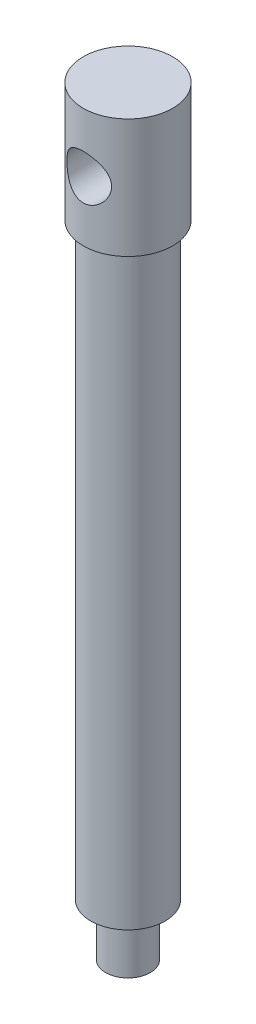
ISO-10303-21;
HEADER;
FILE_DESCRIPTION(('STEP AP214'),'2;1');
FILE_NAME('part.step','',(''),(''),'','','');
FILE_SCHEMA(('AUTOMOTIVE_DESIGN { 1 0 10303 214 1 1 1 1 }'));
ENDSEC;
DATA;
#1=APPLICATION_CONTEXT('core data for automotive mechanical design processes');
#2=APPLICATION_PROTOCOL_DEFINITION('international standard','automotive_design',2000,#1);
#3=PRODUCT_CONTEXT('',#1,'mechanical');
#4=PRODUCT('Part','Part','',(#3));
#5=PRODUCT_RELATED_PRODUCT_CATEGORY('part','',(#4));
#6=PRODUCT_DEFINITION_FORMATION('','',#4);
#7=PRODUCT_DEFINITION_CONTEXT('part definition',#1,'design');
#8=PRODUCT_DEFINITION('design','',#6,#7);
#9=PRODUCT_DEFINITION_SHAPE('','',#8);
#10=(LENGTH_UNIT() NAMED_UNIT(*) SI_UNIT(.MILLI.,.METRE.));
#11=(NAMED_UNIT(*) PLANE_ANGLE_UNIT() SI_UNIT($,.RADIAN.));
#12=(NAMED_UNIT(*) SI_UNIT($,.STERADIAN.) SOLID_ANGLE_UNIT());
#13=UNCERTAINTY_MEASURE_WITH_UNIT(LENGTH_MEASURE(1.E-05),#10,'distance_accuracy_value','');
#14=(GEOMETRIC_REPRESENTATION_CONTEXT(3) GLOBAL_UNCERTAINTY_ASSIGNED_CONTEXT((#13)) GLOBAL_UNIT_ASSIGNED_CONTEXT((#10,
#11,#12)) REPRESENTATION_CONTEXT('',''));
#15=CARTESIAN_POINT('',(0.,0.,0.));
#16=DIRECTION('',(0.,0.,1.));
#17=DIRECTION('',(1.,0.,0.));
#18=AXIS2_PLACEMENT_3D('',#15,#16,#17);
#19=CARTESIAN_POINT('',(0.,8.,0.));
#20=DIRECTION('',(0.,-1.,0.));
#21=DIRECTION('',(0.,0.,-1.));
#22=AXIS2_PLACEMENT_3D('',#19,#20,#21);
#23=CYLINDRICAL_SURFACE('',#22,6.);
#24=CARTESIAN_POINT('',(0.,3.,-6.));
#25=CARTESIAN_POINT('',(-0.0788941476270899,2.99999916125949,-5.99999934964153));
#26=CARTESIAN_POINT('',(-0.15779662040795,2.99688205452446,-5.99843869002385));
#27=CARTESIAN_POINT('',(-0.315001991255922,2.98446072826002,-5.99224358793258));
#28=CARTESIAN_POINT('',(-0.393304603620535,2.97515372593455,-5.98760776295702));
#29=CARTESIAN_POINT('',(-0.626628691373742,2.93804214318136,-5.96921978027472));
#30=CARTESIAN_POINT('',(-0.779952894844981,2.90104717093731,-5.95098734455496));
#31=CARTESIAN_POINT('',(-1.07683586335997,2.80441822557076,-5.90448966743082));
#32=CARTESIAN_POINT('',(-1.22043005484385,2.74487223379164,-5.87626344365679));
#33=CARTESIAN_POINT('',(-1.49540820515376,2.60528874932114,-5.81237302716333));
#34=CARTESIAN_POINT('',(-1.62679312559149,2.52525287229669,-5.77670942093694));
#35=CARTESIAN_POINT('',(-1.88252701271778,2.34144601915048,-5.69868752298932));
#36=CARTESIAN_POINT('',(-2.0059694541685,2.23653205247863,-5.65605474586614));
#37=CARTESIAN_POINT('',(-2.23433451090185,2.00844407851344,-5.56980033629331));
#38=CARTESIAN_POINT('',(-2.33924301355731,1.88525628683475,-5.5261779786051));
#39=CARTESIAN_POINT('',(-2.53576864722249,1.61251563991825,-5.43896347969577));
#40=CARTESIAN_POINT('',(-2.62572411176601,1.46165902554178,-5.39563602686729));
#41=CARTESIAN_POINT('',(-2.7403403145029,1.22404914597679,-5.33782449719395));
#42=CARTESIAN_POINT('',(-2.77516786882118,1.14292907543725,-5.31974570840245));
#43=CARTESIAN_POINT('',(-2.83769299596485,0.977399420119547,-5.28665768365287));
#44=CARTESIAN_POINT('',(-2.86539478083936,0.892991812742365,-5.27164663543394));
#45=CARTESIAN_POINT('',(-2.91188280266506,0.726604203237769,-5.24610341708083));
#46=CARTESIAN_POINT('',(-2.93110042292907,0.644777203243507,-5.23535838565202));
#47=CARTESIAN_POINT('',(-2.9626355938468,0.479445091480399,-5.21757784151146));
#48=CARTESIAN_POINT('',(-2.97495680535109,0.395940894459286,-5.21054036082126));
#49=CARTESIAN_POINT('',(-2.99251382412705,0.227993632583766,-5.20047756645272));
#50=CARTESIAN_POINT('',(-2.99775389857938,0.143551164106335,-5.19744983647106));
#51=CARTESIAN_POINT('',(-3.00108452416055,-0.0254936543414408,-5.19552555967191));
#52=CARTESIAN_POINT('',(-2.9991757574161,-0.11009598828786,-5.19662861870362));
#53=CARTESIAN_POINT('',(-2.98404973540404,-0.342753898322308,-5.20534668059274));
#54=CARTESIAN_POINT('',(-2.96335042632723,-0.490244154154371,-5.21726794353739));
#55=CARTESIAN_POINT('',(-2.90082280036694,-0.77919367682506,-5.25228182412118));
#56=CARTESIAN_POINT('',(-2.85898775295595,-0.920651006950642,-5.2753780002338));
#57=CARTESIAN_POINT('',(-2.75462843937304,-1.19767965029683,-5.33062568888728));
#58=CARTESIAN_POINT('',(-2.69164495870316,-1.33303711175114,-5.36297559567996));
#59=CARTESIAN_POINT('',(-2.54712530575799,-1.59190496331403,-5.43310175251307));
#60=CARTESIAN_POINT('',(-2.46558080007523,-1.71540999648048,-5.47088043711311));
#61=CARTESIAN_POINT('',(-2.27419808739746,-1.96356309377981,-5.55339485686877));
#62=CARTESIAN_POINT('',(-2.16208335434885,-2.0863704423841,-5.59840533924979));
#63=CARTESIAN_POINT('',(-1.91866675699301,-2.31220643420206,-5.6864286668495));
#64=CARTESIAN_POINT('',(-1.78735577540359,-2.41522562490586,-5.72944054996685));
#65=CARTESIAN_POINT('',(-1.50154951155102,-2.60305693201863,-5.81105962769461));
#66=CARTESIAN_POINT('',(-1.3462607732106,-2.68680140369758,-5.84936952731879));
#67=CARTESIAN_POINT('',(-1.02139864805275,-2.82629110075781,-5.91473643118065));
#68=CARTESIAN_POINT('',(-0.851836729203681,-2.88205855854965,-5.94180236767508));
#69=CARTESIAN_POINT('',(-0.518299474608032,-2.95942620793611,-5.97973001282228));
#70=CARTESIAN_POINT('',(-0.355024591545113,-2.98347370638174,-5.99174814919366));
#71=CARTESIAN_POINT('',(-0.0263387999478724,-3.00439419426166,-6.00219040361882));
#72=CARTESIAN_POINT('',(0.13907105958427,-3.00128005713952,-6.00062096160122));
#73=CARTESIAN_POINT('',(0.453698915981444,-2.96937993453979,-5.98473576763842));
#74=CARTESIAN_POINT('',(0.60317822415514,-2.94260240175605,-5.97141737064974));
#75=CARTESIAN_POINT('',(0.895220676900473,-2.8672857843686,-5.93466513944052));
#76=CARTESIAN_POINT('',(1.03778305707535,-2.81874430065139,-5.91123019004896));
#77=CARTESIAN_POINT('',(1.31666582534657,-2.70000460068869,-5.85552754239056));
#78=CARTESIAN_POINT('',(1.45269119100304,-2.62922684965872,-5.82302645301465));
#79=CARTESIAN_POINT('',(1.71138408511219,-2.46867739305272,-5.75231922959683));
#80=CARTESIAN_POINT('',(1.83404588938514,-2.37889759617127,-5.71411066728832));
#81=CARTESIAN_POINT('',(2.07530306780484,-2.17271872405628,-5.63124663977895));
#82=CARTESIAN_POINT('',(2.19231623321556,-2.05457139485521,-5.58632654410486));
#83=CARTESIAN_POINT('',(2.40556896301298,-1.8002245463152,-5.49787174706805));
#84=CARTESIAN_POINT('',(2.50179415686851,-1.66401264341959,-5.4543380217028));
#85=CARTESIAN_POINT('',(2.675123743717,-1.36906903751966,-5.3715357665078));
#86=CARTESIAN_POINT('',(2.75107648817021,-1.20956620203743,-5.33257588763925));
#87=CARTESIAN_POINT('',(2.87424847703564,-0.877469796954639,-5.26722216885657));
#88=CARTESIAN_POINT('',(2.92150474480837,-0.704893419356802,-5.24081214709482));
#89=CARTESIAN_POINT('',(2.98158506492521,-0.369269332469134,-5.2068450303742));
#90=CARTESIAN_POINT('',(2.997278998202,-0.206897243709721,-5.19772150245585));
#91=CARTESIAN_POINT('',(3.00206745414686,0.118341205507284,-5.19496064074354));
#92=CARTESIAN_POINT('',(2.99117350647291,0.281207321142661,-5.20131659437267));
#93=CARTESIAN_POINT('',(2.94577840699521,0.586450491093449,-5.227135856483));
#94=CARTESIAN_POINT('',(2.91362505078136,0.72930136226562,-5.24529281646867));
#95=CARTESIAN_POINT('',(2.82952596688629,1.0074244064572,-5.29113050364646));
#96=CARTESIAN_POINT('',(2.77757387249734,1.14269412552796,-5.3188142941166));
#97=CARTESIAN_POINT('',(2.65144766382427,1.41187436166464,-5.38285583940632));
#98=CARTESIAN_POINT('',(2.57601505988081,1.54508296947888,-5.41967139666624));
#99=CARTESIAN_POINT('',(2.40645126762009,1.7978243449357,-5.49706022440067));
#100=CARTESIAN_POINT('',(2.31231035120759,1.91734994640441,-5.53763544397051));
#101=CARTESIAN_POINT('',(2.094616891292,2.15442285748806,-5.62386853947507));
#102=CARTESIAN_POINT('',(1.96888052183389,2.2699651241614,-5.66954494371954));
#103=CARTESIAN_POINT('',(1.69843715077041,2.47880114007096,-5.75633712356327));
#104=CARTESIAN_POINT('',(1.55371998850183,2.57208289702219,-5.79745043456127));
#105=CARTESIAN_POINT('',(1.32452333533412,2.69317818455659,-5.85251406841986));
#106=CARTESIAN_POINT('',(1.24575314775787,2.73052020024159,-5.86982524242744));
#107=CARTESIAN_POINT('',(1.08479725492719,2.79836167882379,-5.90168845962536));
#108=CARTESIAN_POINT('',(1.00261324805381,2.82886449703348,-5.91624185523758));
#109=CARTESIAN_POINT('',(0.835616997915664,2.88260725599252,-5.94212690185115));
#110=CARTESIAN_POINT('',(0.750810940130686,2.90586304076398,-5.95346557615479));
#111=CARTESIAN_POINT('',(0.579142357408355,2.94488257278059,-5.97260771878739));
#112=CARTESIAN_POINT('',(0.492281122825509,2.96065089655644,-5.98041334646939));
#113=CARTESIAN_POINT('',(0.337824895315461,2.98168467861349,-5.99085829855372));
#114=CARTESIAN_POINT('',(0.270495162095328,2.98854691772596,-5.99428035414515));
#115=CARTESIAN_POINT('',(0.13544567138178,2.99770500144305,-5.99885151538357));
#116=CARTESIAN_POINT('',(0.067725903174862,3.00000072000853,-6.00000055829382));
#117=CARTESIAN_POINT('',(0.,3.,-6.));
#118=B_SPLINE_CURVE_WITH_KNOTS('',3,(#24,#25,#26,#27,#28,#29,#30,#31,#32,#33,#34,#35,#36,#37,
#38,#39,#40,#41,#42,#43,#44,#45,#46,#47,#48,#49,#50,#51,#52,#53,#54,#55,#56,#57,#58,#59,#60,#61,
#62,#63,#64,#65,#66,#67,#68,#69,#70,#71,#72,#73,#74,#75,#76,#77,#78,#79,#80,#81,#82,#83,#84,#85,
#86,#87,#88,#89,#90,#91,#92,#93,#94,#95,#96,#97,#98,#99,#100,#101,#102,#103,#104,#105,#106,#107,
#108,#109,#110,#111,#112,#113,#114,#115,#116,#117),.UNSPECIFIED.,.T.,.F.,(4,2,2,2,2,2,2,2,2,2,2,
2,2,2,2,2,2,2,2,2,2,2,2,2,2,2,2,2,2,2,2,2,2,2,2,2,2,2,2,2,2,2,2,2,2,2,4),(0.,0.236611432443576,
0.473329310437701,0.947100987304416,1.41904300465372,1.89094781992153,2.39140181433109,
2.89223525113893,3.4319083310994,3.70192714967837,3.97178599119154,4.2256372003331,
4.47935352842581,4.73291689564224,4.98645606901569,5.43238672147391,5.87845946700878,
6.33492255429305,6.79159098704508,7.30616358925478,7.82098138719902,8.35970601567165,
8.89800185660681,9.39171406337879,9.88519228458271,10.3404225444221,10.7957029981664,
11.2640010300754,11.7324988716886,12.2470036685628,12.7618630076938,13.3016558140826,
13.8407507075944,14.3280945743223,14.8152271451712,15.2559532566965,15.6968212128814,
16.1673090526395,16.6380421835398,17.1659726319345,17.6941868506379,17.9605054214138,
18.2266930489272,18.4922945660822,18.7577335310501,18.9608446764332,19.1639614277476),.UNSPECIFIED.);
#119=CARTESIAN_POINT('',(0.,3.,-6.));
#120=VERTEX_POINT('',#119);
#121=EDGE_CURVE('E35',#120,#120,#118,.T.);
#122=ORIENTED_EDGE('',*,*,#121,.T.);
#123=EDGE_LOOP('',(#122));
#124=FACE_BOUND('',#123,.T.);
#125=CARTESIAN_POINT('',(3.,0.,5.19615242270663));
#126=CARTESIAN_POINT('',(2.99999910875738,-0.0782002332591003,5.19615338151414));
#127=CARTESIAN_POINT('',(2.99693611207795,-0.156409998464572,5.19792581191127));
#128=CARTESIAN_POINT('',(2.98473565374509,-0.312208075142056,5.20493931657123));
#129=CARTESIAN_POINT('',(2.97559536411629,-0.389796080268497,5.21018200566082));
#130=CARTESIAN_POINT('',(2.9391691225804,-0.62094401424643,5.23088200558207));
#131=CARTESIAN_POINT('',(2.902878058149,-0.772750910533258,5.25131076607215));
#132=CARTESIAN_POINT('',(2.80829998089522,-1.06639163352355,5.3024774692754));
#133=CARTESIAN_POINT('',(2.75012989346617,-1.2082738017509,5.33316051577918));
#134=CARTESIAN_POINT('',(2.61380253964662,-1.48026276170082,5.40128072966972));
#135=CARTESIAN_POINT('',(2.53564419197538,-1.61036891587492,5.43871826241347));
#136=CARTESIAN_POINT('',(2.35399963256537,-1.86692014614772,5.51990583559838));
#137=CARTESIAN_POINT('',(2.24895611137364,-1.99217820215593,5.56392184571631));
#138=CARTESIAN_POINT('',(2.01976141989962,-2.22422436968955,5.651159547025));
#139=CARTESIAN_POINT('',(1.89560077655245,-2.3310032682567,5.69438083245621));
#140=CARTESIAN_POINT('',(1.62146869109162,-2.53010168773234,5.77864428988887));
#141=CARTESIAN_POINT('',(1.47032156718994,-2.62096136592723,5.81934318752246));
#142=CARTESIAN_POINT('',(1.15247107964639,-2.77542249742808,5.89052268800541));
#143=CARTESIAN_POINT('',(0.985777614653092,-2.83904115324658,5.92100973690811));
#144=CARTESIAN_POINT('',(0.654134831556285,-2.93251399798917,5.96641383603058));
#145=CARTESIAN_POINT('',(0.489905370480167,-2.96444857964805,5.98228440595573));
#146=CARTESIAN_POINT('',(0.157711887079232,-3.00049835544401,6.00022751605263));
#147=CARTESIAN_POINT('',(-0.0102498138110369,-3.00463038213226,6.00230840492439));
#148=CARTESIAN_POINT('',(-0.32949757666792,-2.98575996736519,5.9928894562274));
#149=CARTESIAN_POINT('',(-0.480963609704589,-2.96508591192195,5.98255487247965));
#150=CARTESIAN_POINT('',(-0.77794130357984,-2.90135750980351,5.9512273620779));
#151=CARTESIAN_POINT('',(-0.923452517976629,-2.85830148842212,5.93023363786808));
#152=CARTESIAN_POINT('',(-1.20692822064062,-2.75075214423043,5.87914748253372));
#153=CARTESIAN_POINT('',(-1.34476044303001,-2.68597046879936,5.8489331854518));
#154=CARTESIAN_POINT('',(-1.60793023199368,-2.53721034329205,5.78212944004645));
#155=CARTESIAN_POINT('',(-1.73326330217191,-2.45322502049034,5.74553771044373));
#156=CARTESIAN_POINT('',(-1.98052168794677,-2.25931152606046,5.66533158492102));
#157=CARTESIAN_POINT('',(-2.10100497271934,-2.14768148935835,5.62138031742825));
#158=CARTESIAN_POINT('',(-2.32231036115798,-1.90624025809114,5.53363118085844));
#159=CARTESIAN_POINT('',(-2.42311733790258,-1.77641520610432,5.48983345502612));
#160=CARTESIAN_POINT('',(-2.6085269546345,-1.49201785665928,5.40432084665524));
#161=CARTESIAN_POINT('',(-2.691694028528,-1.33639756435402,5.36291485750667));
#162=CARTESIAN_POINT('',(-2.79542837524198,-1.09243694538825,5.30915194408667));
#163=CARTESIAN_POINT('',(-2.82650797342001,-1.00934368959523,5.2926194649543));
#164=CARTESIAN_POINT('',(-2.88131297532033,-0.84019139696557,5.26298473463269));
#165=CARTESIAN_POINT('',(-2.90504291399185,-0.754134225525211,5.24988036897854));
#166=CARTESIAN_POINT('',(-2.94323927983804,-0.586628379775972,5.22855455988393));
#167=CARTESIAN_POINT('',(-2.95828810706486,-0.505350574362155,5.22002982263214));
#168=CARTESIAN_POINT('',(-2.98163903200842,-0.341564761334104,5.20672737157291));
#169=CARTESIAN_POINT('',(-2.98994463830255,-0.259057416251682,5.20194770920409));
#170=CARTESIAN_POINT('',(-2.99968663811345,-0.0935289931972947,5.19633662863608));
#171=CARTESIAN_POINT('',(-3.00112558946313,-0.0105081180563042,5.19550374026212));
#172=CARTESIAN_POINT('',(-2.99712742537403,0.155286460764652,5.19780953199967));
#173=CARTESIAN_POINT('',(-2.99169077406597,0.238060180750522,5.20094794403249));
#174=CARTESIAN_POINT('',(-2.96710135231213,0.466859136042693,5.21504493010248));
#175=CARTESIAN_POINT('',(-2.9405616310018,0.611910810263271,5.23019160660498));
#176=CARTESIAN_POINT('',(-2.86709067362229,0.895130910796866,5.27081666384497));
#177=CARTESIAN_POINT('',(-2.82015283383764,1.03329709183022,5.29629839028765));
#178=CARTESIAN_POINT('',(-2.70494224478443,1.30622610391993,5.35608780273032));
#179=CARTESIAN_POINT('',(-2.63578205088436,1.4405349279041,5.3907496041273));
#180=CARTESIAN_POINT('',(-2.47886133231338,1.69640993836604,5.46468327792416));
#181=CARTESIAN_POINT('',(-2.39109125263821,1.81796953081147,5.50395751387985));
#182=CARTESIAN_POINT('',(-2.18651145695799,2.06093562663186,5.58864005140301));
#183=CARTESIAN_POINT('',(-2.067435804994,2.18039127090002,5.63419752084738));
#184=CARTESIAN_POINT('',(-1.8102134981498,2.39823689529484,5.72202702310923));
#185=CARTESIAN_POINT('',(-1.67206042712515,2.4966197596755,5.76429794308224));
#186=CARTESIAN_POINT('',(-1.37560608443379,2.67172112757365,5.84224085806642));
#187=CARTESIAN_POINT('',(-1.21686929217555,2.74779934188309,5.87770925226883));
#188=CARTESIAN_POINT('',(-0.886567094469551,2.87141372431059,5.93650064667294));
#189=CARTESIAN_POINT('',(-0.715013103124009,2.91897495484196,5.95983430919533));
#190=CARTESIAN_POINT('',(-0.380939047947199,2.98010569184912,5.9900252464518));
#191=CARTESIAN_POINT('',(-0.219034335650393,2.99639363556079,5.99819783930701));
#192=CARTESIAN_POINT('',(0.105377961951197,3.00252978843353,6.00126390919338));
#193=CARTESIAN_POINT('',(0.267885316317459,2.99238725318317,5.99616203476054));
#194=CARTESIAN_POINT('',(0.57761396253614,2.94775080986649,5.97401907190636));
#195=CARTESIAN_POINT('',(0.725136901247723,2.91490556233434,5.95778686442443));
#196=CARTESIAN_POINT('',(1.01233790874441,2.82801889196794,5.91576278551446));
#197=CARTESIAN_POINT('',(1.15201484923628,2.77397442945752,5.88996954319457));
#198=CARTESIAN_POINT('',(1.42627001605164,2.64381927131126,5.829778017116));
#199=CARTESIAN_POINT('',(1.56037465678411,2.56686365846371,5.79505887623287));
#200=CARTESIAN_POINT('',(1.81432469711303,2.39412457858644,5.7206436338201));
#201=CARTESIAN_POINT('',(1.93416350676913,2.29833246401127,5.68094524943991));
#202=CARTESIAN_POINT('',(2.16873884087782,2.07961527751646,5.59585978819439));
#203=CARTESIAN_POINT('',(2.28178066887875,1.9549386792264,5.55029975504518));
#204=CARTESIAN_POINT('',(2.48600225783028,1.68762167192986,5.46188649509677));
#205=CARTESIAN_POINT('',(2.57716267726705,1.54496553896892,5.41903568750872));
#206=CARTESIAN_POINT('',(2.69665559342489,1.31746820669823,5.36004774906988));
#207=CARTESIAN_POINT('',(2.73405408762355,1.23802419901758,5.34101219148464));
#208=CARTESIAN_POINT('',(2.80191257626505,1.07564671699129,5.30572783063718));
#209=CARTESIAN_POINT('',(2.83237614466584,0.992715066251996,5.28947759301443));
#210=CARTESIAN_POINT('',(2.88592624586958,0.824155267630249,5.26045215868186));
#211=CARTESIAN_POINT('',(2.90903175649394,0.738534692758639,5.24766803509091));
#212=CARTESIAN_POINT('',(2.9476242805163,0.565144744685739,5.22608869625113));
#213=CARTESIAN_POINT('',(2.96311662049621,0.47737691907938,5.21729069243665));
#214=CARTESIAN_POINT('',(2.9830938122572,0.324601182240058,5.20588528016134));
#215=CARTESIAN_POINT('',(2.9894274622838,0.259905191093012,5.20224442588138));
#216=CARTESIAN_POINT('',(2.99788106792142,0.130141683200318,5.19737751744686));
#217=CARTESIAN_POINT('',(3.00000074164547,0.0650741418923934,5.1961516248372));
#218=CARTESIAN_POINT('',(3.,0.,5.19615242270663));
#219=B_SPLINE_CURVE_WITH_KNOTS('',3,(#125,#126,#127,#128,#129,#130,#131,#132,#133,#134,#135,
#136,#137,#138,#139,#140,#141,#142,#143,#144,#145,#146,#147,#148,#149,#150,#151,#152,#153,#154,
#155,#156,#157,#158,#159,#160,#161,#162,#163,#164,#165,#166,#167,#168,#169,#170,#171,#172,#173,
#174,#175,#176,#177,#178,#179,#180,#181,#182,#183,#184,#185,#186,#187,#188,#189,#190,#191,#192,
#193,#194,#195,#196,#197,#198,#199,#200,#201,#202,#203,#204,#205,#206,#207,#208,#209,#210,#211,
#212,#213,#214,#215,#216,#217,#218),.UNSPECIFIED.,.T.,.F.,(4,2,2,2,2,2,2,2,2,2,2,2,2,2,2,2,2,2,
2,2,2,2,2,2,2,2,2,2,2,2,2,2,2,2,2,2,2,2,2,2,2,2,2,2,2,2,4),(0.,0.234529430733892,
0.469168072604264,0.938850383294531,1.40605749261242,1.87328988121656,2.37905864237582,
2.88507883741225,3.42520847204402,3.96499651379785,4.46637625391917,4.96745241546232,
5.42495462941727,5.88249108040477,6.34635774681552,6.81039068538927,7.31828744858784,
7.82657315225867,8.36713695676457,8.63752916119813,8.90775419202327,9.15669600787592,
9.40550821320573,9.65422772860785,9.90293045534218,10.3454331624118,10.7880792327729,
11.2512265518736,11.7146122462924,12.2364099671094,12.7583836090371,13.29413310208,
13.8294110539541,14.3155757713756,14.8015702635101,15.2555404058358,15.7095756650514,
16.1830301812752,16.6567025627126,17.177514915193,17.6987859450456,17.9680115893229,
18.2370981707631,18.5054849980179,18.7736837791728,18.9688338446807,19.1639969639894),.UNSPECIFIED.);
#220=CARTESIAN_POINT('',(3.,0.,5.19615242270663));
#221=VERTEX_POINT('',#220);
#222=EDGE_CURVE('E60',#221,#221,#219,.T.);
#223=ORIENTED_EDGE('',*,*,#222,.T.);
#224=EDGE_LOOP('',(#223));
#225=FACE_BOUND('',#224,.T.);
#226=CARTESIAN_POINT('',(0.,8.,0.));
#227=DIRECTION('',(0.,1.,0.));
#228=DIRECTION('',(0.,0.,1.));
#229=AXIS2_PLACEMENT_3D('',#226,#227,#228);
#230=CIRCLE('',#229,6.);
#231=CARTESIAN_POINT('',(0.,8.,6.));
#232=VERTEX_POINT('',#231);
#233=EDGE_CURVE('E48',#232,#232,#230,.T.);
#234=ORIENTED_EDGE('',*,*,#233,.F.);
#235=EDGE_LOOP('',(#234));
#236=FACE_BOUND('',#235,.T.);
#237=CARTESIAN_POINT('',(0.,-8.,0.));
#238=DIRECTION('',(0.,1.,0.));
#239=DIRECTION('',(0.,0.,1.));
#240=AXIS2_PLACEMENT_3D('',#237,#238,#239);
#241=CIRCLE('',#240,6.);
#242=CARTESIAN_POINT('',(0.,-8.,6.));
#243=VERTEX_POINT('',#242);
#244=EDGE_CURVE('E55',#243,#243,#241,.T.);
#245=ORIENTED_EDGE('',*,*,#244,.T.);
#246=EDGE_LOOP('',(#245));
#247=FACE_BOUND('',#246,.T.);
#248=ADVANCED_FACE('F31',(#124,#225,#236,#247),#23,.T.);
#249=CARTESIAN_POINT('',(0.,8.,0.));
#250=DIRECTION('',(0.,1.,0.));
#251=DIRECTION('',(0.,0.,1.));
#252=AXIS2_PLACEMENT_3D('',#249,#250,#251);
#253=PLANE('',#252);
#254=ORIENTED_EDGE('',*,*,#233,.T.);
#255=EDGE_LOOP('',(#254));
#256=FACE_BOUND('',#255,.T.);
#257=ADVANCED_FACE('F88',(#256),#253,.T.);
#258=CARTESIAN_POINT('',(0.,-8.,0.));
#259=DIRECTION('',(0.,1.,0.));
#260=DIRECTION('',(0.,0.,1.));
#261=AXIS2_PLACEMENT_3D('',#258,#259,#260);
#262=PLANE('',#261);
#263=CARTESIAN_POINT('',(0.,-8.,0.));
#264=DIRECTION('',(0.,-1.,0.));
#265=DIRECTION('',(0.,0.,-1.));
#266=AXIS2_PLACEMENT_3D('',#263,#264,#265);
#267=CIRCLE('',#266,5.);
#268=CARTESIAN_POINT('',(0.,-8.,-5.));
#269=VERTEX_POINT('',#268);
#270=EDGE_CURVE('E43',#269,#269,#267,.T.);
#271=ORIENTED_EDGE('',*,*,#270,.F.);
#272=EDGE_LOOP('',(#271));
#273=FACE_BOUND('',#272,.T.);
#274=ORIENTED_EDGE('',*,*,#244,.F.);
#275=EDGE_LOOP('',(#274));
#276=FACE_BOUND('',#275,.T.);
#277=ADVANCED_FACE('F86',(#273,#276),#262,.F.);
#278=CARTESIAN_POINT('',(0.,-87.,0.));
#279=DIRECTION('',(0.,1.,0.));
#280=DIRECTION('',(0.,0.,1.));
#281=AXIS2_PLACEMENT_3D('',#278,#279,#280);
#282=CYLINDRICAL_SURFACE('',#281,5.);
#283=CARTESIAN_POINT('',(0.,-87.,0.));
#284=DIRECTION('',(0.,-1.,0.));
#285=DIRECTION('',(0.,0.,-1.));
#286=AXIS2_PLACEMENT_3D('',#283,#284,#285);
#287=CIRCLE('',#286,5.);
#288=CARTESIAN_POINT('',(0.,-87.,-5.));
#289=VERTEX_POINT('',#288);
#290=EDGE_CURVE('E53',#289,#289,#287,.T.);
#291=ORIENTED_EDGE('',*,*,#290,.F.);
#292=EDGE_LOOP('',(#291));
#293=FACE_BOUND('',#292,.T.);
#294=ORIENTED_EDGE('',*,*,#270,.T.);
#295=EDGE_LOOP('',(#294));
#296=FACE_BOUND('',#295,.T.);
#297=ADVANCED_FACE('F82',(#293,#296),#282,.T.);
#298=CARTESIAN_POINT('',(0.,-87.,0.));
#299=DIRECTION('',(0.,-1.,0.));
#300=DIRECTION('',(0.,0.,-1.));
#301=AXIS2_PLACEMENT_3D('',#298,#299,#300);
#302=PLANE('',#301);
#303=CARTESIAN_POINT('',(0.,-87.,0.));
#304=DIRECTION('',(0.,-1.,0.));
#305=DIRECTION('',(0.,0.,-1.));
#306=AXIS2_PLACEMENT_3D('',#303,#304,#305);
#307=CIRCLE('',#306,3.);
#308=CARTESIAN_POINT('',(0.,-87.,-3.));
#309=VERTEX_POINT('',#308);
#310=EDGE_CURVE('E10',#309,#309,#307,.T.);
#311=ORIENTED_EDGE('',*,*,#310,.F.);
#312=EDGE_LOOP('',(#311));
#313=FACE_BOUND('',#312,.T.);
#314=ORIENTED_EDGE('',*,*,#290,.T.);
#315=EDGE_LOOP('',(#314));
#316=FACE_BOUND('',#315,.T.);
#317=ADVANCED_FACE('F78',(#313,#316),#302,.T.);
#318=CARTESIAN_POINT('',(0.,-94.,0.));
#319=DIRECTION('',(0.,1.,0.));
#320=DIRECTION('',(0.,0.,1.));
#321=AXIS2_PLACEMENT_3D('',#318,#319,#320);
#322=CYLINDRICAL_SURFACE('',#321,3.);
#323=CARTESIAN_POINT('',(0.,-94.,0.));
#324=DIRECTION('',(0.,-1.,0.));
#325=DIRECTION('',(0.,0.,-1.));
#326=AXIS2_PLACEMENT_3D('',#323,#324,#325);
#327=CIRCLE('',#326,3.);
#328=CARTESIAN_POINT('',(0.,-94.,-3.));
#329=VERTEX_POINT('',#328);
#330=EDGE_CURVE('E52',#329,#329,#327,.T.);
#331=ORIENTED_EDGE('',*,*,#330,.F.);
#332=EDGE_LOOP('',(#331));
#333=FACE_BOUND('',#332,.T.);
#334=ORIENTED_EDGE('',*,*,#310,.T.);
#335=EDGE_LOOP('',(#334));
#336=FACE_BOUND('',#335,.T.);
#337=ADVANCED_FACE('F74',(#333,#336),#322,.T.);
#338=CARTESIAN_POINT('',(0.,-94.,0.));
#339=DIRECTION('',(0.,-1.,0.));
#340=DIRECTION('',(0.,0.,-1.));
#341=AXIS2_PLACEMENT_3D('',#338,#339,#340);
#342=PLANE('',#341);
#343=ORIENTED_EDGE('',*,*,#330,.T.);
#344=EDGE_LOOP('',(#343));
#345=FACE_BOUND('',#344,.T.);
#346=ADVANCED_FACE('F69',(#345),#342,.T.);
#347=CARTESIAN_POINT('',(0.,0.,-8.5));
#348=DIRECTION('',(0.,0.,1.));
#349=DIRECTION('',(1.,0.,0.));
#350=AXIS2_PLACEMENT_3D('',#347,#348,#349);
#351=CYLINDRICAL_SURFACE('',#350,3.);
#352=ORIENTED_EDGE('',*,*,#222,.F.);
#353=EDGE_LOOP('',(#352));
#354=FACE_BOUND('',#353,.T.);
#355=ORIENTED_EDGE('',*,*,#121,.F.);
#356=EDGE_LOOP('',(#355));
#357=FACE_BOUND('',#356,.T.);
#358=ADVANCED_FACE('F65',(#354,#357),#351,.F.);
#359=CLOSED_SHELL('',(#248,#257,#277,#297,#317,#337,#346,#358));
#360=MANIFOLD_SOLID_BREP('B2',#359);
#361=ADVANCED_BREP_SHAPE_REPRESENTATION('',(#18,#360),#14);
#362=SHAPE_DEFINITION_REPRESENTATION(#9,#361);
ENDSEC;
END-ISO-10303-21;
